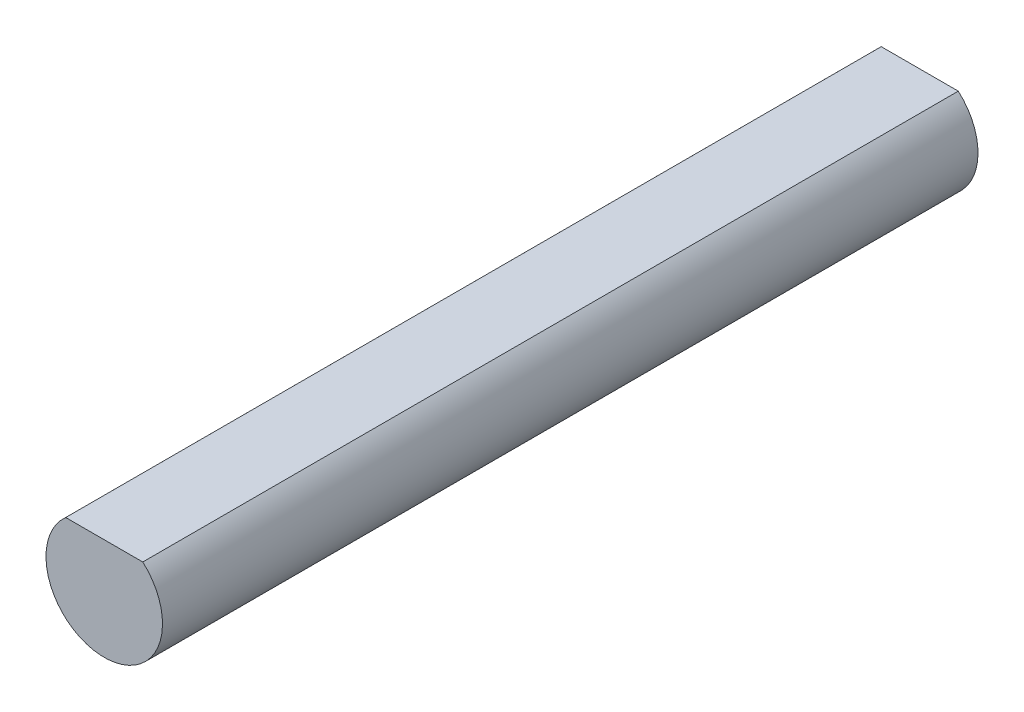
ISO-10303-21;
HEADER;
FILE_DESCRIPTION(('STEP AP214'),'2;1');
FILE_NAME('part.step','',(''),(''),'','','');
FILE_SCHEMA(('AUTOMOTIVE_DESIGN { 1 0 10303 214 1 1 1 1 }'));
ENDSEC;
DATA;
#1=APPLICATION_CONTEXT('core data for automotive mechanical design processes');
#2=APPLICATION_PROTOCOL_DEFINITION('international standard','automotive_design',2000,#1);
#3=PRODUCT_CONTEXT('',#1,'mechanical');
#4=PRODUCT('Part','Part','',(#3));
#5=PRODUCT_RELATED_PRODUCT_CATEGORY('part','',(#4));
#6=PRODUCT_DEFINITION_FORMATION('','',#4);
#7=PRODUCT_DEFINITION_CONTEXT('part definition',#1,'design');
#8=PRODUCT_DEFINITION('design','',#6,#7);
#9=PRODUCT_DEFINITION_SHAPE('','',#8);
#10=(LENGTH_UNIT() NAMED_UNIT(*) SI_UNIT(.MILLI.,.METRE.));
#11=(NAMED_UNIT(*) PLANE_ANGLE_UNIT() SI_UNIT($,.RADIAN.));
#12=(NAMED_UNIT(*) SI_UNIT($,.STERADIAN.) SOLID_ANGLE_UNIT());
#13=UNCERTAINTY_MEASURE_WITH_UNIT(LENGTH_MEASURE(1.E-05),#10,'distance_accuracy_value','');
#14=(GEOMETRIC_REPRESENTATION_CONTEXT(3) GLOBAL_UNCERTAINTY_ASSIGNED_CONTEXT((#13)) GLOBAL_UNIT_ASSIGNED_CONTEXT((#10,
#11,#12)) REPRESENTATION_CONTEXT('',''));
#15=CARTESIAN_POINT('',(0.,0.,0.));
#16=DIRECTION('',(0.,0.,1.));
#17=DIRECTION('',(1.,0.,0.));
#18=AXIS2_PLACEMENT_3D('',#15,#16,#17);
#19=CARTESIAN_POINT('',(0.,0.,28.));
#20=DIRECTION('',(0.,0.,-1.));
#21=DIRECTION('',(-1.,0.,0.));
#22=AXIS2_PLACEMENT_3D('',#19,#20,#21);
#23=CYLINDRICAL_SURFACE('',#22,2.);
#24=CARTESIAN_POINT('',(0.,0.,0.));
#25=DIRECTION('',(0.,0.,1.));
#26=DIRECTION('',(1.,0.,0.));
#27=AXIS2_PLACEMENT_3D('',#24,#25,#26);
#28=CIRCLE('',#27,2.);
#29=CARTESIAN_POINT('',(-1.3228756555323,1.5,0.));
#30=VERTEX_POINT('',#29);
#31=CARTESIAN_POINT('',(1.3228756555323,1.5,0.));
#32=VERTEX_POINT('',#31);
#33=EDGE_CURVE('E65',#30,#32,#28,.T.);
#34=ORIENTED_EDGE('',*,*,#33,.T.);
#35=DIRECTION('',(0.,0.,-1.));
#36=VECTOR('',#35,1.);
#37=CARTESIAN_POINT('',(1.3228756555323,1.5,28.));
#38=LINE('',#37,#36);
#39=CARTESIAN_POINT('',(1.3228756555323,1.5,28.));
#40=VERTEX_POINT('',#39);
#41=EDGE_CURVE('E11',#40,#32,#38,.T.);
#42=ORIENTED_EDGE('',*,*,#41,.F.);
#43=CARTESIAN_POINT('',(0.,0.,28.));
#44=DIRECTION('',(0.,0.,1.));
#45=DIRECTION('',(1.,0.,0.));
#46=AXIS2_PLACEMENT_3D('',#43,#44,#45);
#47=CIRCLE('',#46,2.);
#48=CARTESIAN_POINT('',(-1.3228756555323,1.5,28.));
#49=VERTEX_POINT('',#48);
#50=EDGE_CURVE('E64',#49,#40,#47,.T.);
#51=ORIENTED_EDGE('',*,*,#50,.F.);
#52=DIRECTION('',(0.,0.,-1.));
#53=VECTOR('',#52,1.);
#54=CARTESIAN_POINT('',(-1.3228756555323,1.5,28.));
#55=LINE('',#54,#53);
#56=EDGE_CURVE('E42',#49,#30,#55,.T.);
#57=ORIENTED_EDGE('',*,*,#56,.T.);
#58=EDGE_LOOP('',(#34,#42,#51,#57));
#59=FACE_BOUND('',#58,.T.);
#60=ADVANCED_FACE('F34',(#59),#23,.T.);
#61=CARTESIAN_POINT('',(-1.3228756555323,1.5,28.));
#62=DIRECTION('',(0.,-1.,0.));
#63=DIRECTION('',(0.,0.,-1.));
#64=AXIS2_PLACEMENT_3D('',#61,#62,#63);
#65=PLANE('',#64);
#66=DIRECTION('',(-1.,0.,0.));
#67=VECTOR('',#66,1.);
#68=CARTESIAN_POINT('',(-1.3228756555323,1.5,0.));
#69=LINE('',#68,#67);
#70=EDGE_CURVE('E57',#32,#30,#69,.T.);
#71=ORIENTED_EDGE('',*,*,#70,.T.);
#72=ORIENTED_EDGE('',*,*,#56,.F.);
#73=DIRECTION('',(-1.,0.,0.));
#74=VECTOR('',#73,1.);
#75=CARTESIAN_POINT('',(-1.3228756555323,1.5,28.));
#76=LINE('',#75,#74);
#77=EDGE_CURVE('E49',#40,#49,#76,.T.);
#78=ORIENTED_EDGE('',*,*,#77,.F.);
#79=ORIENTED_EDGE('',*,*,#41,.T.);
#80=EDGE_LOOP('',(#71,#72,#78,#79));
#81=FACE_BOUND('',#80,.T.);
#82=ADVANCED_FACE('F60',(#81),#65,.F.);
#83=CARTESIAN_POINT('',(0.,0.,28.));
#84=DIRECTION('',(0.,0.,1.));
#85=DIRECTION('',(1.,0.,0.));
#86=AXIS2_PLACEMENT_3D('',#83,#84,#85);
#87=PLANE('',#86);
#88=ORIENTED_EDGE('',*,*,#50,.T.);
#89=ORIENTED_EDGE('',*,*,#77,.T.);
#90=EDGE_LOOP('',(#88,#89));
#91=FACE_BOUND('',#90,.T.);
#92=ADVANCED_FACE('F72',(#91),#87,.T.);
#93=CARTESIAN_POINT('',(0.,0.,0.));
#94=DIRECTION('',(0.,0.,1.));
#95=DIRECTION('',(1.,0.,0.));
#96=AXIS2_PLACEMENT_3D('',#93,#94,#95);
#97=PLANE('',#96);
#98=ORIENTED_EDGE('',*,*,#33,.F.);
#99=ORIENTED_EDGE('',*,*,#70,.F.);
#100=EDGE_LOOP('',(#98,#99));
#101=FACE_BOUND('',#100,.T.);
#102=ADVANCED_FACE('F68',(#101),#97,.F.);
#103=CLOSED_SHELL('',(#60,#82,#92,#102));
#104=MANIFOLD_SOLID_BREP('B2',#103);
#105=ADVANCED_BREP_SHAPE_REPRESENTATION('',(#18,#104),#14);
#106=SHAPE_DEFINITION_REPRESENTATION(#9,#105);
ENDSEC;
END-ISO-10303-21;
